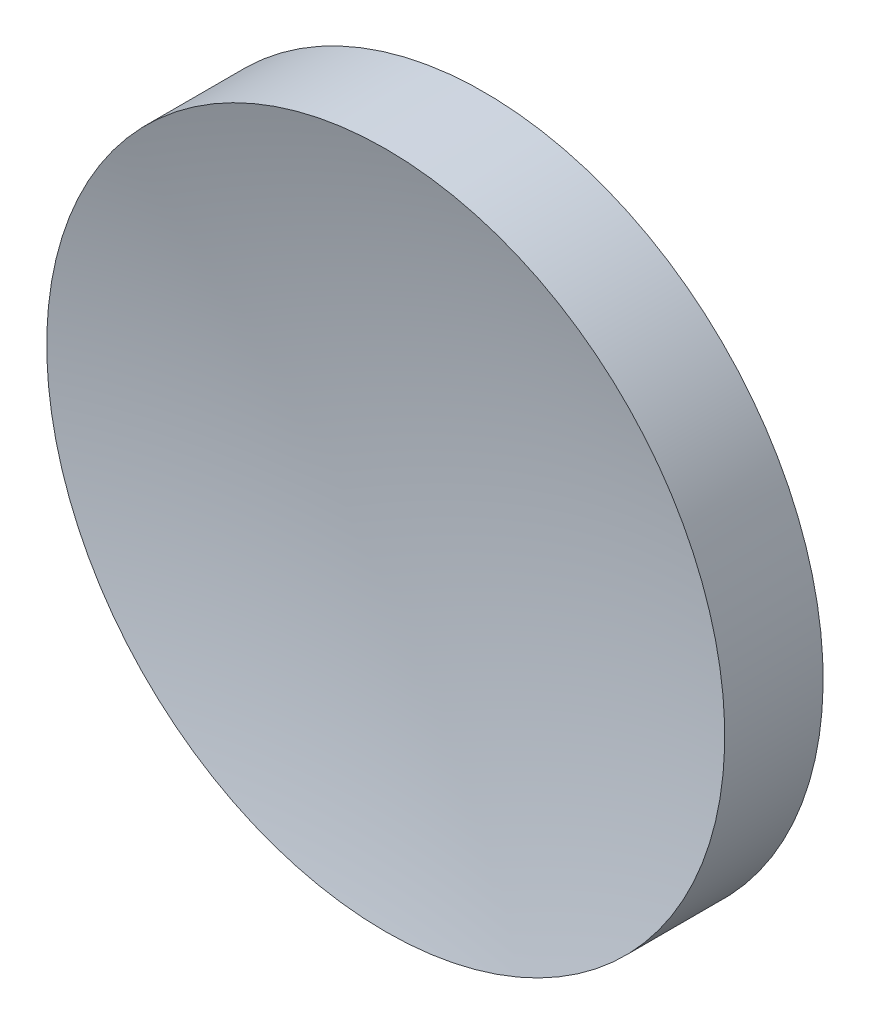
ISO-10303-21;
HEADER;
FILE_DESCRIPTION(('STEP AP214'),'2;1');
FILE_NAME('part.step','',(''),(''),'','','');
FILE_SCHEMA(('AUTOMOTIVE_DESIGN { 1 0 10303 214 1 1 1 1 }'));
ENDSEC;
DATA;
#1=APPLICATION_CONTEXT('core data for automotive mechanical design processes');
#2=APPLICATION_PROTOCOL_DEFINITION('international standard','automotive_design',2000,#1);
#3=PRODUCT_CONTEXT('',#1,'mechanical');
#4=PRODUCT('Part','Part','',(#3));
#5=PRODUCT_RELATED_PRODUCT_CATEGORY('part','',(#4));
#6=PRODUCT_DEFINITION_FORMATION('','',#4);
#7=PRODUCT_DEFINITION_CONTEXT('part definition',#1,'design');
#8=PRODUCT_DEFINITION('design','',#6,#7);
#9=PRODUCT_DEFINITION_SHAPE('','',#8);
#10=(LENGTH_UNIT() NAMED_UNIT(*) SI_UNIT(.MILLI.,.METRE.));
#11=(NAMED_UNIT(*) PLANE_ANGLE_UNIT() SI_UNIT($,.RADIAN.));
#12=(NAMED_UNIT(*) SI_UNIT($,.STERADIAN.) SOLID_ANGLE_UNIT());
#13=UNCERTAINTY_MEASURE_WITH_UNIT(LENGTH_MEASURE(1.E-05),#10,'distance_accuracy_value','');
#14=(GEOMETRIC_REPRESENTATION_CONTEXT(3) GLOBAL_UNCERTAINTY_ASSIGNED_CONTEXT((#13)) GLOBAL_UNIT_ASSIGNED_CONTEXT((#10,
#11,#12)) REPRESENTATION_CONTEXT('',''));
#15=CARTESIAN_POINT('',(0.,0.,0.));
#16=DIRECTION('',(0.,0.,1.));
#17=DIRECTION('',(1.,0.,0.));
#18=AXIS2_PLACEMENT_3D('',#15,#16,#17);
#19=CARTESIAN_POINT('',(0.,0.,52.663));
#20=DIRECTION('',(0.,0.,1.));
#21=DIRECTION('',(0.,1.,0.));
#22=AXIS2_PLACEMENT_3D('',#19,#20,#21);
#23=SPHERICAL_SURFACE('',#22,50.663);
#24=CARTESIAN_POINT('',(0.,0.,3.61761725095826));
#25=DIRECTION('',(0.,0.,1.));
#26=DIRECTION('',(0.,-1.,0.));
#27=AXIS2_PLACEMENT_3D('',#24,#25,#26);
#28=CIRCLE('',#27,12.7);
#29=CARTESIAN_POINT('',(0.,-12.7,3.61761725095825));
#30=VERTEX_POINT('',#29);
#31=EDGE_CURVE('E36',#30,#30,#28,.T.);
#32=ORIENTED_EDGE('',*,*,#31,.T.);
#33=EDGE_LOOP('',(#32));
#34=FACE_BOUND('',#33,.T.);
#35=ADVANCED_FACE('F30',(#34),#23,.F.);
#36=CARTESIAN_POINT('',(0.,0.,40.713));
#37=DIRECTION('',(0.,0.,1.));
#38=DIRECTION('',(0.,-1.,0.));
#39=AXIS2_PLACEMENT_3D('',#36,#37,#38);
#40=SPHERICAL_SURFACE('',#39,42.713);
#41=CARTESIAN_POINT('',(0.,0.,-0.0682502137931092));
#42=DIRECTION('',(0.,0.,1.));
#43=DIRECTION('',(0.,-1.,0.));
#44=AXIS2_PLACEMENT_3D('',#41,#42,#43);
#45=CIRCLE('',#44,12.7);
#46=CARTESIAN_POINT('',(0.,-12.7,-0.0682502137931116));
#47=VERTEX_POINT('',#46);
#48=EDGE_CURVE('E10',#47,#47,#45,.T.);
#49=ORIENTED_EDGE('',*,*,#48,.F.);
#50=EDGE_LOOP('',(#49));
#51=FACE_BOUND('',#50,.T.);
#52=ADVANCED_FACE('F45',(#51),#40,.T.);
#53=CARTESIAN_POINT('',(0.,0.,2.));
#54=DIRECTION('',(0.,0.,1.));
#55=DIRECTION('',(0.,-1.,0.));
#56=AXIS2_PLACEMENT_3D('',#53,#54,#55);
#57=CYLINDRICAL_SURFACE('',#56,12.7);
#58=ORIENTED_EDGE('',*,*,#31,.F.);
#59=EDGE_LOOP('',(#58));
#60=FACE_BOUND('',#59,.T.);
#61=ORIENTED_EDGE('',*,*,#48,.T.);
#62=EDGE_LOOP('',(#61));
#63=FACE_BOUND('',#62,.T.);
#64=ADVANCED_FACE('F43',(#60,#63),#57,.T.);
#65=CLOSED_SHELL('',(#35,#52,#64));
#66=MANIFOLD_SOLID_BREP('B2',#65);
#67=ADVANCED_BREP_SHAPE_REPRESENTATION('',(#18,#66),#14);
#68=SHAPE_DEFINITION_REPRESENTATION(#9,#67);
ENDSEC;
END-ISO-10303-21;
